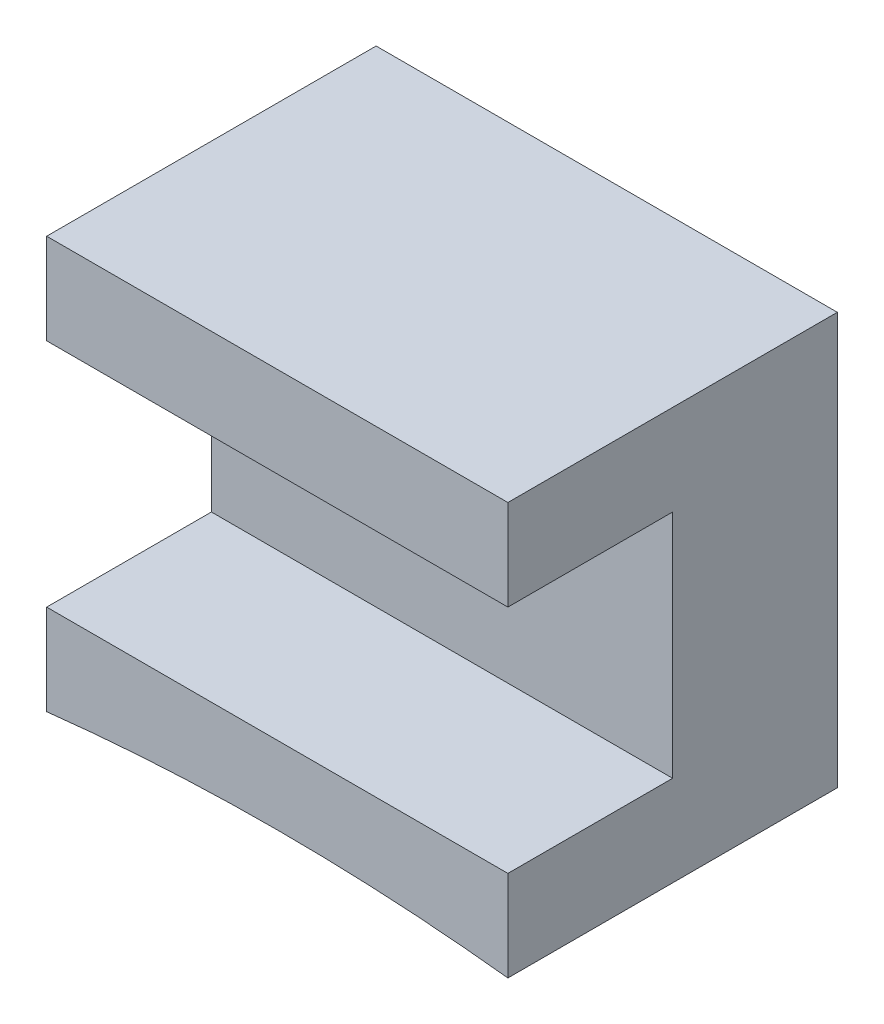
ISO-10303-21;
HEADER;
FILE_DESCRIPTION(('STEP AP214'),'2;1');
FILE_NAME('part.step','',(''),(''),'','','');
FILE_SCHEMA(('AUTOMOTIVE_DESIGN { 1 0 10303 214 1 1 1 1 }'));
ENDSEC;
DATA;
#1=APPLICATION_CONTEXT('core data for automotive mechanical design processes');
#2=APPLICATION_PROTOCOL_DEFINITION('international standard','automotive_design',2000,#1);
#3=PRODUCT_CONTEXT('',#1,'mechanical');
#4=PRODUCT('Part','Part','',(#3));
#5=PRODUCT_RELATED_PRODUCT_CATEGORY('part','',(#4));
#6=PRODUCT_DEFINITION_FORMATION('','',#4);
#7=PRODUCT_DEFINITION_CONTEXT('part definition',#1,'design');
#8=PRODUCT_DEFINITION('design','',#6,#7);
#9=PRODUCT_DEFINITION_SHAPE('','',#8);
#10=(LENGTH_UNIT() NAMED_UNIT(*) SI_UNIT(.MILLI.,.METRE.));
#11=(NAMED_UNIT(*) PLANE_ANGLE_UNIT() SI_UNIT($,.RADIAN.));
#12=(NAMED_UNIT(*) SI_UNIT($,.STERADIAN.) SOLID_ANGLE_UNIT());
#13=UNCERTAINTY_MEASURE_WITH_UNIT(LENGTH_MEASURE(1.E-05),#10,'distance_accuracy_value','');
#14=(GEOMETRIC_REPRESENTATION_CONTEXT(3) GLOBAL_UNCERTAINTY_ASSIGNED_CONTEXT((#13)) GLOBAL_UNIT_ASSIGNED_CONTEXT((#10,
#11,#12)) REPRESENTATION_CONTEXT('',''));
#15=CARTESIAN_POINT('',(0.,0.,0.));
#16=DIRECTION('',(0.,0.,1.));
#17=DIRECTION('',(1.,0.,0.));
#18=AXIS2_PLACEMENT_3D('',#15,#16,#17);
#19=CARTESIAN_POINT('',(0.,-31.75,5.08));
#20=DIRECTION('',(0.,0.,-1.));
#21=DIRECTION('',(-1.,0.,0.));
#22=AXIS2_PLACEMENT_3D('',#19,#20,#21);
#23=PLANE('',#22);
#24=DIRECTION('',(0.,-1.,0.));
#25=VECTOR('',#24,1.);
#26=CARTESIAN_POINT('',(-3.556,-0.199764438280355,5.08));
#27=LINE('',#26,#25);
#28=CARTESIAN_POINT('',(-3.556,6.15023556171965,5.08));
#29=VERTEX_POINT('',#28);
#30=CARTESIAN_POINT('',(-3.556,4.75323556171965,5.08));
#31=VERTEX_POINT('',#30);
#32=EDGE_CURVE('E136',#29,#31,#27,.T.);
#33=ORIENTED_EDGE('',*,*,#32,.T.);
#34=DIRECTION('',(-1.,0.,0.));
#35=VECTOR('',#34,1.);
#36=CARTESIAN_POINT('',(-3.556,4.75323556171965,5.08));
#37=LINE('',#36,#35);
#38=CARTESIAN_POINT('',(3.556,4.75323556171965,5.08));
#39=VERTEX_POINT('',#38);
#40=EDGE_CURVE('E121',#39,#31,#37,.T.);
#41=ORIENTED_EDGE('',*,*,#40,.F.);
#42=DIRECTION('',(0.,1.,0.));
#43=VECTOR('',#42,1.);
#44=CARTESIAN_POINT('',(3.556,-0.199764438280357,5.08));
#45=LINE('',#44,#43);
#46=CARTESIAN_POINT('',(3.556,6.15023556171964,5.08));
#47=VERTEX_POINT('',#46);
#48=EDGE_CURVE('E132',#39,#47,#45,.T.);
#49=ORIENTED_EDGE('',*,*,#48,.T.);
#50=DIRECTION('',(-1.,0.,0.));
#51=VECTOR('',#50,1.);
#52=CARTESIAN_POINT('',(-3.556,6.15023556171965,5.08));
#53=LINE('',#52,#51);
#54=EDGE_CURVE('E134',#47,#29,#53,.T.);
#55=ORIENTED_EDGE('',*,*,#54,.T.);
#56=EDGE_LOOP('',(#33,#41,#49,#55));
#57=FACE_BOUND('',#56,.T.);
#58=ADVANCED_FACE('F33',(#57),#23,.F.);
#59=CARTESIAN_POINT('',(0.,-31.75,5.08));
#60=DIRECTION('',(0.,0.,-1.));
#61=DIRECTION('',(-1.,0.,0.));
#62=AXIS2_PLACEMENT_3D('',#59,#60,#61);
#63=CYLINDRICAL_SURFACE('',#62,31.75);
#64=CARTESIAN_POINT('',(0.,-31.75,0.));
#65=DIRECTION('',(0.,0.,-1.));
#66=DIRECTION('',(-1.,0.,0.));
#67=AXIS2_PLACEMENT_3D('',#64,#65,#66);
#68=CIRCLE('',#67,31.75);
#69=CARTESIAN_POINT('',(-3.556,-0.199764438280355,0.));
#70=VERTEX_POINT('',#69);
#71=CARTESIAN_POINT('',(3.556,-0.199764438280357,0.));
#72=VERTEX_POINT('',#71);
#73=EDGE_CURVE('E140',#70,#72,#68,.T.);
#74=ORIENTED_EDGE('',*,*,#73,.T.);
#75=DIRECTION('',(0.,0.,-1.));
#76=VECTOR('',#75,1.);
#77=CARTESIAN_POINT('',(3.556,-0.199764438280357,5.08));
#78=LINE('',#77,#76);
#79=CARTESIAN_POINT('',(3.556,-0.199764438280357,5.08));
#80=VERTEX_POINT('',#79);
#81=EDGE_CURVE('E11',#80,#72,#78,.T.);
#82=ORIENTED_EDGE('',*,*,#81,.F.);
#83=CARTESIAN_POINT('',(0.,-31.75,5.08));
#84=DIRECTION('',(0.,0.,-1.));
#85=DIRECTION('',(-1.,0.,0.));
#86=AXIS2_PLACEMENT_3D('',#83,#84,#85);
#87=CIRCLE('',#86,31.75);
#88=CARTESIAN_POINT('',(-3.556,-0.199764438280355,5.08));
#89=VERTEX_POINT('',#88);
#90=EDGE_CURVE('E130',#89,#80,#87,.T.);
#91=ORIENTED_EDGE('',*,*,#90,.F.);
#92=DIRECTION('',(0.,0.,-1.));
#93=VECTOR('',#92,1.);
#94=CARTESIAN_POINT('',(-3.556,-0.199764438280355,5.08));
#95=LINE('',#94,#93);
#96=EDGE_CURVE('E139',#89,#70,#95,.T.);
#97=ORIENTED_EDGE('',*,*,#96,.T.);
#98=EDGE_LOOP('',(#74,#82,#91,#97));
#99=FACE_BOUND('',#98,.T.);
#100=ADVANCED_FACE('F35',(#99),#63,.F.);
#101=CARTESIAN_POINT('',(3.556,-0.199764438280357,5.08));
#102=DIRECTION('',(-1.,0.,0.));
#103=DIRECTION('',(0.,0.,1.));
#104=AXIS2_PLACEMENT_3D('',#101,#102,#103);
#105=PLANE('',#104);
#106=ORIENTED_EDGE('',*,*,#48,.F.);
#107=DIRECTION('',(0.,0.,1.));
#108=VECTOR('',#107,1.);
#109=CARTESIAN_POINT('',(3.556,4.75323556171965,2.54));
#110=LINE('',#109,#108);
#111=CARTESIAN_POINT('',(3.556,4.75323556171965,2.54));
#112=VERTEX_POINT('',#111);
#113=EDGE_CURVE('E125',#112,#39,#110,.T.);
#114=ORIENTED_EDGE('',*,*,#113,.F.);
#115=DIRECTION('',(0.,1.,0.));
#116=VECTOR('',#115,1.);
#117=CARTESIAN_POINT('',(3.556,4.75323556171965,2.54));
#118=LINE('',#117,#116);
#119=CARTESIAN_POINT('',(3.556,1.19723556171966,2.54));
#120=VERTEX_POINT('',#119);
#121=EDGE_CURVE('E112',#120,#112,#118,.T.);
#122=ORIENTED_EDGE('',*,*,#121,.F.);
#123=DIRECTION('',(0.,0.,1.));
#124=VECTOR('',#123,1.);
#125=CARTESIAN_POINT('',(3.556,1.19723556171966,2.54));
#126=LINE('',#125,#124);
#127=CARTESIAN_POINT('',(3.556,1.19723556171966,5.08));
#128=VERTEX_POINT('',#127);
#129=EDGE_CURVE('E109',#120,#128,#126,.T.);
#130=ORIENTED_EDGE('',*,*,#129,.T.);
#131=EDGE_CURVE('E85',#80,#128,#45,.T.);
#132=ORIENTED_EDGE('',*,*,#131,.F.);
#133=ORIENTED_EDGE('',*,*,#81,.T.);
#134=DIRECTION('',(0.,1.,0.));
#135=VECTOR('',#134,1.);
#136=CARTESIAN_POINT('',(3.556,-0.199764438280357,0.));
#137=LINE('',#136,#135);
#138=CARTESIAN_POINT('',(3.556,6.15023556171964,0.));
#139=VERTEX_POINT('',#138);
#140=EDGE_CURVE('E143',#72,#139,#137,.T.);
#141=ORIENTED_EDGE('',*,*,#140,.T.);
#142=DIRECTION('',(0.,0.,-1.));
#143=VECTOR('',#142,1.);
#144=CARTESIAN_POINT('',(3.556,6.15023556171964,5.08));
#145=LINE('',#144,#143);
#146=EDGE_CURVE('E41',#47,#139,#145,.T.);
#147=ORIENTED_EDGE('',*,*,#146,.F.);
#148=EDGE_LOOP('',(#106,#114,#122,#130,#132,#133,#141,#147));
#149=FACE_BOUND('',#148,.T.);
#150=ADVANCED_FACE('F177',(#149),#105,.F.);
#151=CARTESIAN_POINT('',(-3.556,6.15023556171965,5.08));
#152=DIRECTION('',(0.,-1.,0.));
#153=DIRECTION('',(1.,0.,0.));
#154=AXIS2_PLACEMENT_3D('',#151,#152,#153);
#155=PLANE('',#154);
#156=DIRECTION('',(-1.,0.,0.));
#157=VECTOR('',#156,1.);
#158=CARTESIAN_POINT('',(-3.556,6.15023556171965,0.));
#159=LINE('',#158,#157);
#160=CARTESIAN_POINT('',(-3.556,6.15023556171965,0.));
#161=VERTEX_POINT('',#160);
#162=EDGE_CURVE('E146',#139,#161,#159,.T.);
#163=ORIENTED_EDGE('',*,*,#162,.T.);
#164=DIRECTION('',(0.,0.,-1.));
#165=VECTOR('',#164,1.);
#166=CARTESIAN_POINT('',(-3.556,6.15023556171965,5.08));
#167=LINE('',#166,#165);
#168=EDGE_CURVE('E150',#29,#161,#167,.T.);
#169=ORIENTED_EDGE('',*,*,#168,.F.);
#170=ORIENTED_EDGE('',*,*,#54,.F.);
#171=ORIENTED_EDGE('',*,*,#146,.T.);
#172=EDGE_LOOP('',(#163,#169,#170,#171));
#173=FACE_BOUND('',#172,.T.);
#174=ADVANCED_FACE('F156',(#173),#155,.F.);
#175=CARTESIAN_POINT('',(-3.556,-0.199764438280355,5.08));
#176=DIRECTION('',(1.,0.,0.));
#177=DIRECTION('',(0.,0.,-1.));
#178=AXIS2_PLACEMENT_3D('',#175,#176,#177);
#179=PLANE('',#178);
#180=DIRECTION('',(0.,-1.,0.));
#181=VECTOR('',#180,1.);
#182=CARTESIAN_POINT('',(-3.556,4.75323556171965,2.54));
#183=LINE('',#182,#181);
#184=CARTESIAN_POINT('',(-3.556,4.75323556171965,2.54));
#185=VERTEX_POINT('',#184);
#186=CARTESIAN_POINT('',(-3.556,1.19723556171965,2.54));
#187=VERTEX_POINT('',#186);
#188=EDGE_CURVE('E113',#185,#187,#183,.T.);
#189=ORIENTED_EDGE('',*,*,#188,.F.);
#190=DIRECTION('',(0.,0.,1.));
#191=VECTOR('',#190,1.);
#192=CARTESIAN_POINT('',(-3.556,4.75323556171965,2.54));
#193=LINE('',#192,#191);
#194=EDGE_CURVE('E144',#185,#31,#193,.T.);
#195=ORIENTED_EDGE('',*,*,#194,.T.);
#196=ORIENTED_EDGE('',*,*,#32,.F.);
#197=ORIENTED_EDGE('',*,*,#168,.T.);
#198=DIRECTION('',(0.,-1.,0.));
#199=VECTOR('',#198,1.);
#200=CARTESIAN_POINT('',(-3.556,-0.199764438280355,0.));
#201=LINE('',#200,#199);
#202=EDGE_CURVE('E78',#161,#70,#201,.T.);
#203=ORIENTED_EDGE('',*,*,#202,.T.);
#204=ORIENTED_EDGE('',*,*,#96,.F.);
#205=CARTESIAN_POINT('',(-3.556,1.19723556171965,5.08));
#206=VERTEX_POINT('',#205);
#207=EDGE_CURVE('E56',#206,#89,#27,.T.);
#208=ORIENTED_EDGE('',*,*,#207,.F.);
#209=DIRECTION('',(0.,0.,1.));
#210=VECTOR('',#209,1.);
#211=CARTESIAN_POINT('',(-3.556,1.19723556171965,2.54));
#212=LINE('',#211,#210);
#213=EDGE_CURVE('E48',#187,#206,#212,.T.);
#214=ORIENTED_EDGE('',*,*,#213,.F.);
#215=EDGE_LOOP('',(#189,#195,#196,#197,#203,#204,#208,#214));
#216=FACE_BOUND('',#215,.T.);
#217=ADVANCED_FACE('F123',(#216),#179,.F.);
#218=ORIENTED_EDGE('',*,*,#131,.T.);
#219=DIRECTION('',(1.,0.,0.));
#220=VECTOR('',#219,1.);
#221=CARTESIAN_POINT('',(-3.556,1.19723556171965,5.08));
#222=LINE('',#221,#220);
#223=EDGE_CURVE('E166',#206,#128,#222,.T.);
#224=ORIENTED_EDGE('',*,*,#223,.F.);
#225=ORIENTED_EDGE('',*,*,#207,.T.);
#226=ORIENTED_EDGE('',*,*,#90,.T.);
#227=EDGE_LOOP('',(#218,#224,#225,#226));
#228=FACE_BOUND('',#227,.T.);
#229=ADVANCED_FACE('F165',(#228),#23,.F.);
#230=CARTESIAN_POINT('',(0.,-31.75,0.));
#231=DIRECTION('',(0.,0.,-1.));
#232=DIRECTION('',(-1.,0.,0.));
#233=AXIS2_PLACEMENT_3D('',#230,#231,#232);
#234=PLANE('',#233);
#235=ORIENTED_EDGE('',*,*,#73,.F.);
#236=ORIENTED_EDGE('',*,*,#202,.F.);
#237=ORIENTED_EDGE('',*,*,#162,.F.);
#238=ORIENTED_EDGE('',*,*,#140,.F.);
#239=EDGE_LOOP('',(#235,#236,#237,#238));
#240=FACE_BOUND('',#239,.T.);
#241=ADVANCED_FACE('F161',(#240),#234,.T.);
#242=CARTESIAN_POINT('',(-3.556,4.75323556171965,2.54));
#243=DIRECTION('',(0.,1.,0.));
#244=DIRECTION('',(0.,0.,1.));
#245=AXIS2_PLACEMENT_3D('',#242,#243,#244);
#246=PLANE('',#245);
#247=ORIENTED_EDGE('',*,*,#40,.T.);
#248=ORIENTED_EDGE('',*,*,#194,.F.);
#249=DIRECTION('',(-1.,0.,0.));
#250=VECTOR('',#249,1.);
#251=CARTESIAN_POINT('',(-3.556,4.75323556171965,2.54));
#252=LINE('',#251,#250);
#253=EDGE_CURVE('E119',#112,#185,#252,.T.);
#254=ORIENTED_EDGE('',*,*,#253,.F.);
#255=ORIENTED_EDGE('',*,*,#113,.T.);
#256=EDGE_LOOP('',(#247,#248,#254,#255));
#257=FACE_BOUND('',#256,.T.);
#258=ADVANCED_FACE('F174',(#257),#246,.F.);
#259=CARTESIAN_POINT('',(-3.556,1.19723556171965,2.54));
#260=DIRECTION('',(0.,-1.,0.));
#261=DIRECTION('',(1.,0.,0.));
#262=AXIS2_PLACEMENT_3D('',#259,#260,#261);
#263=PLANE('',#262);
#264=ORIENTED_EDGE('',*,*,#223,.T.);
#265=ORIENTED_EDGE('',*,*,#129,.F.);
#266=DIRECTION('',(1.,0.,0.));
#267=VECTOR('',#266,1.);
#268=CARTESIAN_POINT('',(-3.556,1.19723556171965,2.54));
#269=LINE('',#268,#267);
#270=EDGE_CURVE('E106',#187,#120,#269,.T.);
#271=ORIENTED_EDGE('',*,*,#270,.F.);
#272=ORIENTED_EDGE('',*,*,#213,.T.);
#273=EDGE_LOOP('',(#264,#265,#271,#272));
#274=FACE_BOUND('',#273,.T.);
#275=ADVANCED_FACE('F108',(#274),#263,.F.);
#276=CARTESIAN_POINT('',(0.,0.,2.54));
#277=DIRECTION('',(0.,0.,1.));
#278=DIRECTION('',(1.,0.,0.));
#279=AXIS2_PLACEMENT_3D('',#276,#277,#278);
#280=PLANE('',#279);
#281=ORIENTED_EDGE('',*,*,#188,.T.);
#282=ORIENTED_EDGE('',*,*,#270,.T.);
#283=ORIENTED_EDGE('',*,*,#121,.T.);
#284=ORIENTED_EDGE('',*,*,#253,.T.);
#285=EDGE_LOOP('',(#281,#282,#283,#284));
#286=FACE_BOUND('',#285,.T.);
#287=ADVANCED_FACE('F117',(#286),#280,.T.);
#288=CLOSED_SHELL('',(#58,#100,#150,#174,#217,#229,#241,#258,#275,#287));
#289=MANIFOLD_SOLID_BREP('B2',#288);
#290=ADVANCED_BREP_SHAPE_REPRESENTATION('',(#18,#289),#14);
#291=SHAPE_DEFINITION_REPRESENTATION(#9,#290);
ENDSEC;
END-ISO-10303-21;
